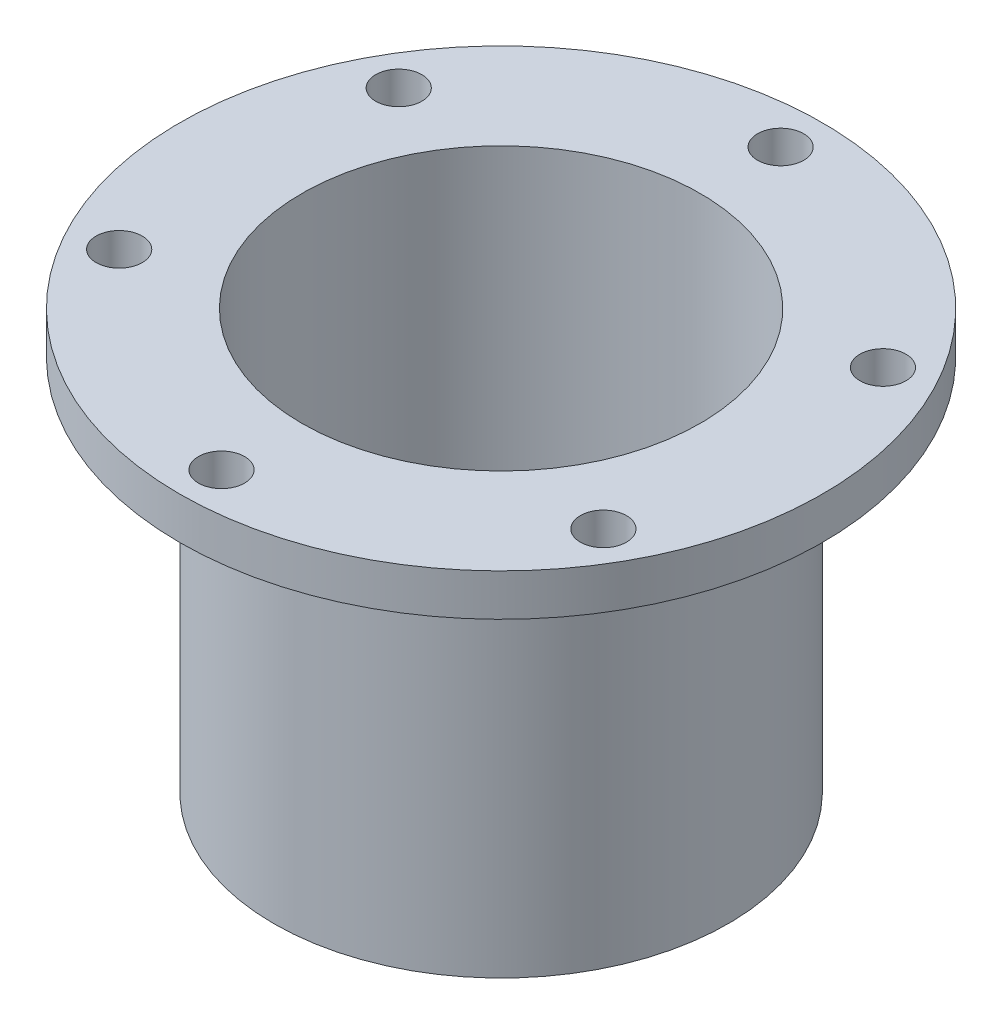
ISO-10303-21;
HEADER;
FILE_DESCRIPTION(('STEP AP214'),'2;1');
FILE_NAME('part.step','',(''),(''),'','','');
FILE_SCHEMA(('AUTOMOTIVE_DESIGN { 1 0 10303 214 1 1 1 1 }'));
ENDSEC;
DATA;
#1=APPLICATION_CONTEXT('core data for automotive mechanical design processes');
#2=APPLICATION_PROTOCOL_DEFINITION('international standard','automotive_design',2000,#1);
#3=PRODUCT_CONTEXT('',#1,'mechanical');
#4=PRODUCT('Part','Part','',(#3));
#5=PRODUCT_RELATED_PRODUCT_CATEGORY('part','',(#4));
#6=PRODUCT_DEFINITION_FORMATION('','',#4);
#7=PRODUCT_DEFINITION_CONTEXT('part definition',#1,'design');
#8=PRODUCT_DEFINITION('design','',#6,#7);
#9=PRODUCT_DEFINITION_SHAPE('','',#8);
#10=(LENGTH_UNIT() NAMED_UNIT(*) SI_UNIT(.MILLI.,.METRE.));
#11=(NAMED_UNIT(*) PLANE_ANGLE_UNIT() SI_UNIT($,.RADIAN.));
#12=(NAMED_UNIT(*) SI_UNIT($,.STERADIAN.) SOLID_ANGLE_UNIT());
#13=UNCERTAINTY_MEASURE_WITH_UNIT(LENGTH_MEASURE(1.E-05),#10,'distance_accuracy_value','');
#14=(GEOMETRIC_REPRESENTATION_CONTEXT(3) GLOBAL_UNCERTAINTY_ASSIGNED_CONTEXT((#13)) GLOBAL_UNIT_ASSIGNED_CONTEXT((#10,
#11,#12)) REPRESENTATION_CONTEXT('',''));
#15=CARTESIAN_POINT('',(0.,0.,0.));
#16=DIRECTION('',(0.,0.,1.));
#17=DIRECTION('',(1.,0.,0.));
#18=AXIS2_PLACEMENT_3D('',#15,#16,#17);
#19=CARTESIAN_POINT('',(0.,27.,0.));
#20=DIRECTION('',(0.,-1.,0.));
#21=DIRECTION('',(0.,0.,-1.));
#22=AXIS2_PLACEMENT_3D('',#19,#20,#21);
#23=CYLINDRICAL_SURFACE('',#22,16.25);
#24=CARTESIAN_POINT('',(0.,27.,0.));
#25=DIRECTION('',(0.,1.,0.));
#26=DIRECTION('',(0.,0.,1.));
#27=AXIS2_PLACEMENT_3D('',#24,#25,#26);
#28=CIRCLE('',#27,16.25);
#29=CARTESIAN_POINT('',(0.,27.,16.25));
#30=VERTEX_POINT('',#29);
#31=EDGE_CURVE('E10',#30,#30,#28,.T.);
#32=ORIENTED_EDGE('',*,*,#31,.F.);
#33=EDGE_LOOP('',(#32));
#34=FACE_BOUND('',#33,.T.);
#35=CARTESIAN_POINT('',(0.,0.,0.));
#36=DIRECTION('',(0.,1.,0.));
#37=DIRECTION('',(0.,0.,1.));
#38=AXIS2_PLACEMENT_3D('',#35,#36,#37);
#39=CIRCLE('',#38,16.25);
#40=CARTESIAN_POINT('',(0.,0.,16.25));
#41=VERTEX_POINT('',#40);
#42=EDGE_CURVE('E39',#41,#41,#39,.T.);
#43=ORIENTED_EDGE('',*,*,#42,.T.);
#44=EDGE_LOOP('',(#43));
#45=FACE_BOUND('',#44,.T.);
#46=ADVANCED_FACE('F32',(#34,#45),#23,.T.);
#47=CARTESIAN_POINT('',(0.,0.,0.));
#48=DIRECTION('',(0.,1.,0.));
#49=DIRECTION('',(0.,0.,1.));
#50=AXIS2_PLACEMENT_3D('',#47,#48,#49);
#51=PLANE('',#50);
#52=CARTESIAN_POINT('',(4.74999999999995,0.,8.2272413359522));
#53=DIRECTION('',(0.,-1.,0.));
#54=DIRECTION('',(0.,0.,-1.));
#55=AXIS2_PLACEMENT_3D('',#52,#53,#54);
#56=CIRCLE('',#55,1.65);
#57=CARTESIAN_POINT('',(4.74999999999995,0.,6.57724133595219));
#58=VERTEX_POINT('',#57);
#59=EDGE_CURVE('E105',#58,#58,#56,.T.);
#60=ORIENTED_EDGE('',*,*,#59,.F.);
#61=EDGE_LOOP('',(#60));
#62=FACE_BOUND('',#61,.T.);
#63=CARTESIAN_POINT('',(9.5,0.,0.));
#64=DIRECTION('',(0.,-1.,0.));
#65=DIRECTION('',(0.,0.,-1.));
#66=AXIS2_PLACEMENT_3D('',#63,#64,#65);
#67=CIRCLE('',#66,1.65000000000002);
#68=CARTESIAN_POINT('',(9.5,0.,-1.64999999999996));
#69=VERTEX_POINT('',#68);
#70=EDGE_CURVE('E108',#69,#69,#67,.T.);
#71=ORIENTED_EDGE('',*,*,#70,.F.);
#72=EDGE_LOOP('',(#71));
#73=FACE_BOUND('',#72,.T.);
#74=CARTESIAN_POINT('',(4.75000000000005,0.,-8.22724133595214));
#75=DIRECTION('',(0.,-1.,0.));
#76=DIRECTION('',(0.,0.,-1.));
#77=AXIS2_PLACEMENT_3D('',#74,#75,#76);
#78=CIRCLE('',#77,1.65000000000004);
#79=CARTESIAN_POINT('',(4.75000000000005,0.,-9.87724133595217));
#80=VERTEX_POINT('',#79);
#81=EDGE_CURVE('E111',#80,#80,#78,.T.);
#82=ORIENTED_EDGE('',*,*,#81,.F.);
#83=EDGE_LOOP('',(#82));
#84=FACE_BOUND('',#83,.T.);
#85=CARTESIAN_POINT('',(-4.74999999999995,0.,-8.2272413359522));
#86=DIRECTION('',(0.,-1.,0.));
#87=DIRECTION('',(0.,0.,-1.));
#88=AXIS2_PLACEMENT_3D('',#85,#86,#87);
#89=CIRCLE('',#88,1.65000000000005);
#90=CARTESIAN_POINT('',(-4.74999999999995,0.,-9.87724133595224));
#91=VERTEX_POINT('',#90);
#92=EDGE_CURVE('E102',#91,#91,#89,.T.);
#93=ORIENTED_EDGE('',*,*,#92,.F.);
#94=EDGE_LOOP('',(#93));
#95=FACE_BOUND('',#94,.T.);
#96=CARTESIAN_POINT('',(-9.5,0.,0.));
#97=DIRECTION('',(0.,-1.,0.));
#98=DIRECTION('',(0.,0.,-1.));
#99=AXIS2_PLACEMENT_3D('',#96,#97,#98);
#100=CIRCLE('',#99,1.65000000000006);
#101=CARTESIAN_POINT('',(-9.5,0.,-1.65000000000012));
#102=VERTEX_POINT('',#101);
#103=EDGE_CURVE('E99',#102,#102,#100,.T.);
#104=ORIENTED_EDGE('',*,*,#103,.F.);
#105=EDGE_LOOP('',(#104));
#106=FACE_BOUND('',#105,.T.);
#107=CARTESIAN_POINT('',(-4.75000000000006,0.,8.22724133595213));
#108=DIRECTION('',(0.,-1.,0.));
#109=DIRECTION('',(0.,0.,-1.));
#110=AXIS2_PLACEMENT_3D('',#107,#108,#109);
#111=CIRCLE('',#110,1.65000000000008);
#112=CARTESIAN_POINT('',(-4.75000000000006,0.,6.57724133595205));
#113=VERTEX_POINT('',#112);
#114=EDGE_CURVE('E97',#113,#113,#111,.T.);
#115=ORIENTED_EDGE('',*,*,#114,.F.);
#116=EDGE_LOOP('',(#115));
#117=FACE_BOUND('',#116,.T.);
#118=CARTESIAN_POINT('',(0.,0.,0.));
#119=DIRECTION('',(0.,-1.,0.));
#120=DIRECTION('',(0.,0.,-1.));
#121=AXIS2_PLACEMENT_3D('',#118,#119,#120);
#122=CIRCLE('',#121,6.75);
#123=CARTESIAN_POINT('',(0.,0.,-6.75));
#124=VERTEX_POINT('',#123);
#125=EDGE_CURVE('E53',#124,#124,#122,.T.);
#126=ORIENTED_EDGE('',*,*,#125,.F.);
#127=EDGE_LOOP('',(#126));
#128=FACE_BOUND('',#127,.T.);
#129=ORIENTED_EDGE('',*,*,#42,.F.);
#130=EDGE_LOOP('',(#129));
#131=FACE_BOUND('',#130,.T.);
#132=ADVANCED_FACE('F79',(#62,#73,#84,#95,#106,#117,#128,#131),#51,.F.);
#133=CARTESIAN_POINT('',(0.,27.,0.));
#134=DIRECTION('',(0.,-1.,0.));
#135=DIRECTION('',(0.,0.,-1.));
#136=AXIS2_PLACEMENT_3D('',#133,#134,#135);
#137=CYLINDRICAL_SURFACE('',#136,14.25);
#138=CARTESIAN_POINT('',(0.,2.,0.));
#139=DIRECTION('',(0.,1.,0.));
#140=DIRECTION('',(0.,0.,1.));
#141=AXIS2_PLACEMENT_3D('',#138,#139,#140);
#142=CIRCLE('',#141,14.25);
#143=CARTESIAN_POINT('',(0.,2.,14.25));
#144=VERTEX_POINT('',#143);
#145=EDGE_CURVE('E44',#144,#144,#142,.T.);
#146=ORIENTED_EDGE('',*,*,#145,.F.);
#147=EDGE_LOOP('',(#146));
#148=FACE_BOUND('',#147,.T.);
#149=CARTESIAN_POINT('',(0.,30.,0.));
#150=DIRECTION('',(0.,1.,0.));
#151=DIRECTION('',(0.,0.,1.));
#152=AXIS2_PLACEMENT_3D('',#149,#150,#151);
#153=CIRCLE('',#152,14.25);
#154=CARTESIAN_POINT('',(0.,30.,14.25));
#155=VERTEX_POINT('',#154);
#156=EDGE_CURVE('E83',#155,#155,#153,.T.);
#157=ORIENTED_EDGE('',*,*,#156,.T.);
#158=EDGE_LOOP('',(#157));
#159=FACE_BOUND('',#158,.T.);
#160=ADVANCED_FACE('F76',(#148,#159),#137,.F.);
#161=CARTESIAN_POINT('',(0.,2.,0.));
#162=DIRECTION('',(0.,1.,0.));
#163=DIRECTION('',(0.,0.,1.));
#164=AXIS2_PLACEMENT_3D('',#161,#162,#163);
#165=PLANE('',#164);
#166=CARTESIAN_POINT('',(4.74999999999995,2.,8.2272413359522));
#167=DIRECTION('',(0.,1.,0.));
#168=DIRECTION('',(0.,0.,1.));
#169=AXIS2_PLACEMENT_3D('',#166,#167,#168);
#170=CIRCLE('',#169,1.65);
#171=CARTESIAN_POINT('',(4.74999999999995,2.,9.8772413359522));
#172=VERTEX_POINT('',#171);
#173=EDGE_CURVE('E35',#172,#172,#170,.T.);
#174=ORIENTED_EDGE('',*,*,#173,.F.);
#175=EDGE_LOOP('',(#174));
#176=FACE_BOUND('',#175,.T.);
#177=CARTESIAN_POINT('',(9.5,2.,0.));
#178=DIRECTION('',(0.,1.,0.));
#179=DIRECTION('',(0.,0.,1.));
#180=AXIS2_PLACEMENT_3D('',#177,#178,#179);
#181=CIRCLE('',#180,1.65000000000002);
#182=CARTESIAN_POINT('',(9.5,2.,1.65000000000008));
#183=VERTEX_POINT('',#182);
#184=EDGE_CURVE('E64',#183,#183,#181,.T.);
#185=ORIENTED_EDGE('',*,*,#184,.F.);
#186=EDGE_LOOP('',(#185));
#187=FACE_BOUND('',#186,.T.);
#188=CARTESIAN_POINT('',(4.75000000000005,2.,-8.22724133595214));
#189=DIRECTION('',(0.,1.,0.));
#190=DIRECTION('',(0.,0.,1.));
#191=AXIS2_PLACEMENT_3D('',#188,#189,#190);
#192=CIRCLE('',#191,1.65000000000004);
#193=CARTESIAN_POINT('',(4.75000000000005,2.,-6.5772413359521));
#194=VERTEX_POINT('',#193);
#195=EDGE_CURVE('E62',#194,#194,#192,.T.);
#196=ORIENTED_EDGE('',*,*,#195,.F.);
#197=EDGE_LOOP('',(#196));
#198=FACE_BOUND('',#197,.T.);
#199=CARTESIAN_POINT('',(-4.74999999999995,2.,-8.2272413359522));
#200=DIRECTION('',(0.,1.,0.));
#201=DIRECTION('',(0.,0.,1.));
#202=AXIS2_PLACEMENT_3D('',#199,#200,#201);
#203=CIRCLE('',#202,1.65000000000005);
#204=CARTESIAN_POINT('',(-4.74999999999995,2.,-6.57724133595215));
#205=VERTEX_POINT('',#204);
#206=EDGE_CURVE('E59',#205,#205,#203,.T.);
#207=ORIENTED_EDGE('',*,*,#206,.F.);
#208=EDGE_LOOP('',(#207));
#209=FACE_BOUND('',#208,.T.);
#210=CARTESIAN_POINT('',(-9.5,2.,0.));
#211=DIRECTION('',(0.,1.,0.));
#212=DIRECTION('',(0.,0.,1.));
#213=AXIS2_PLACEMENT_3D('',#210,#211,#212);
#214=CIRCLE('',#213,1.65000000000006);
#215=CARTESIAN_POINT('',(-9.5,2.,1.65));
#216=VERTEX_POINT('',#215);
#217=EDGE_CURVE('E56',#216,#216,#214,.T.);
#218=ORIENTED_EDGE('',*,*,#217,.F.);
#219=EDGE_LOOP('',(#218));
#220=FACE_BOUND('',#219,.T.);
#221=CARTESIAN_POINT('',(-4.75000000000006,2.,8.22724133595213));
#222=DIRECTION('',(0.,1.,0.));
#223=DIRECTION('',(0.,0.,1.));
#224=AXIS2_PLACEMENT_3D('',#221,#222,#223);
#225=CIRCLE('',#224,1.65000000000008);
#226=CARTESIAN_POINT('',(-4.75000000000006,2.,9.87724133595221));
#227=VERTEX_POINT('',#226);
#228=EDGE_CURVE('E52',#227,#227,#225,.T.);
#229=ORIENTED_EDGE('',*,*,#228,.F.);
#230=EDGE_LOOP('',(#229));
#231=FACE_BOUND('',#230,.T.);
#232=CARTESIAN_POINT('',(0.,2.,0.));
#233=DIRECTION('',(0.,1.,0.));
#234=DIRECTION('',(0.,0.,1.));
#235=AXIS2_PLACEMENT_3D('',#232,#233,#234);
#236=CIRCLE('',#235,6.75);
#237=CARTESIAN_POINT('',(0.,2.,6.75));
#238=VERTEX_POINT('',#237);
#239=EDGE_CURVE('E49',#238,#238,#236,.T.);
#240=ORIENTED_EDGE('',*,*,#239,.F.);
#241=EDGE_LOOP('',(#240));
#242=FACE_BOUND('',#241,.T.);
#243=ORIENTED_EDGE('',*,*,#145,.T.);
#244=EDGE_LOOP('',(#243));
#245=FACE_BOUND('',#244,.T.);
#246=ADVANCED_FACE('F74',(#176,#187,#198,#209,#220,#231,#242,#245),#165,.T.);
#247=CARTESIAN_POINT('',(0.,27.,0.));
#248=DIRECTION('',(0.,-1.,0.));
#249=DIRECTION('',(0.,0.,-1.));
#250=AXIS2_PLACEMENT_3D('',#247,#248,#249);
#251=CYLINDRICAL_SURFACE('',#250,6.75);
#252=ORIENTED_EDGE('',*,*,#239,.T.);
#253=EDGE_LOOP('',(#252));
#254=FACE_BOUND('',#253,.T.);
#255=ORIENTED_EDGE('',*,*,#125,.T.);
#256=EDGE_LOOP('',(#255));
#257=FACE_BOUND('',#256,.T.);
#258=ADVANCED_FACE('F118',(#254,#257),#251,.F.);
#259=CARTESIAN_POINT('',(-4.75000000000006,27.,8.22724133595213));
#260=DIRECTION('',(0.,-1.,0.));
#261=DIRECTION('',(0.,0.,-1.));
#262=AXIS2_PLACEMENT_3D('',#259,#260,#261);
#263=CYLINDRICAL_SURFACE('',#262,1.65000000000008);
#264=ORIENTED_EDGE('',*,*,#228,.T.);
#265=EDGE_LOOP('',(#264));
#266=FACE_BOUND('',#265,.T.);
#267=ORIENTED_EDGE('',*,*,#114,.T.);
#268=EDGE_LOOP('',(#267));
#269=FACE_BOUND('',#268,.T.);
#270=ADVANCED_FACE('F152',(#266,#269),#263,.F.);
#271=CARTESIAN_POINT('',(-9.5,27.,0.));
#272=DIRECTION('',(0.,-1.,0.));
#273=DIRECTION('',(0.,0.,-1.));
#274=AXIS2_PLACEMENT_3D('',#271,#272,#273);
#275=CYLINDRICAL_SURFACE('',#274,1.65000000000006);
#276=ORIENTED_EDGE('',*,*,#217,.T.);
#277=EDGE_LOOP('',(#276));
#278=FACE_BOUND('',#277,.T.);
#279=ORIENTED_EDGE('',*,*,#103,.T.);
#280=EDGE_LOOP('',(#279));
#281=FACE_BOUND('',#280,.T.);
#282=ADVANCED_FACE('F160',(#278,#281),#275,.F.);
#283=CARTESIAN_POINT('',(-4.74999999999995,27.,-8.2272413359522));
#284=DIRECTION('',(0.,-1.,0.));
#285=DIRECTION('',(0.,0.,-1.));
#286=AXIS2_PLACEMENT_3D('',#283,#284,#285);
#287=CYLINDRICAL_SURFACE('',#286,1.65000000000005);
#288=ORIENTED_EDGE('',*,*,#206,.T.);
#289=EDGE_LOOP('',(#288));
#290=FACE_BOUND('',#289,.T.);
#291=ORIENTED_EDGE('',*,*,#92,.T.);
#292=EDGE_LOOP('',(#291));
#293=FACE_BOUND('',#292,.T.);
#294=ADVANCED_FACE('F168',(#290,#293),#287,.F.);
#295=CARTESIAN_POINT('',(4.75000000000005,27.,-8.22724133595214));
#296=DIRECTION('',(0.,-1.,0.));
#297=DIRECTION('',(0.,0.,-1.));
#298=AXIS2_PLACEMENT_3D('',#295,#296,#297);
#299=CYLINDRICAL_SURFACE('',#298,1.65000000000004);
#300=ORIENTED_EDGE('',*,*,#195,.T.);
#301=EDGE_LOOP('',(#300));
#302=FACE_BOUND('',#301,.T.);
#303=ORIENTED_EDGE('',*,*,#81,.T.);
#304=EDGE_LOOP('',(#303));
#305=FACE_BOUND('',#304,.T.);
#306=ADVANCED_FACE('F176',(#302,#305),#299,.F.);
#307=CARTESIAN_POINT('',(9.5,27.,0.));
#308=DIRECTION('',(0.,-1.,0.));
#309=DIRECTION('',(0.,0.,-1.));
#310=AXIS2_PLACEMENT_3D('',#307,#308,#309);
#311=CYLINDRICAL_SURFACE('',#310,1.65000000000002);
#312=ORIENTED_EDGE('',*,*,#184,.T.);
#313=EDGE_LOOP('',(#312));
#314=FACE_BOUND('',#313,.T.);
#315=ORIENTED_EDGE('',*,*,#70,.T.);
#316=EDGE_LOOP('',(#315));
#317=FACE_BOUND('',#316,.T.);
#318=ADVANCED_FACE('F184',(#314,#317),#311,.F.);
#319=CARTESIAN_POINT('',(4.74999999999995,27.,8.2272413359522));
#320=DIRECTION('',(0.,-1.,0.));
#321=DIRECTION('',(0.,0.,-1.));
#322=AXIS2_PLACEMENT_3D('',#319,#320,#321);
#323=CYLINDRICAL_SURFACE('',#322,1.65);
#324=ORIENTED_EDGE('',*,*,#173,.T.);
#325=EDGE_LOOP('',(#324));
#326=FACE_BOUND('',#325,.T.);
#327=ORIENTED_EDGE('',*,*,#59,.T.);
#328=EDGE_LOOP('',(#327));
#329=FACE_BOUND('',#328,.T.);
#330=ADVANCED_FACE('F192',(#326,#329),#323,.F.);
#331=CARTESIAN_POINT('',(0.,30.,0.));
#332=DIRECTION('',(0.,1.,0.));
#333=DIRECTION('',(0.,0.,1.));
#334=AXIS2_PLACEMENT_3D('',#331,#332,#333);
#335=PLANE('',#334);
#336=CARTESIAN_POINT('',(-17.3205080756888,30.,10.));
#337=DIRECTION('',(0.,1.,0.));
#338=DIRECTION('',(0.,0.,1.));
#339=AXIS2_PLACEMENT_3D('',#336,#337,#338);
#340=CIRCLE('',#339,1.65);
#341=CARTESIAN_POINT('',(-17.3205080756888,30.,11.65));
#342=VERTEX_POINT('',#341);
#343=EDGE_CURVE('E325',#342,#342,#340,.T.);
#344=ORIENTED_EDGE('',*,*,#343,.F.);
#345=EDGE_LOOP('',(#344));
#346=FACE_BOUND('',#345,.T.);
#347=CARTESIAN_POINT('',(17.3205080756888,30.,10.));
#348=DIRECTION('',(0.,1.,0.));
#349=DIRECTION('',(0.,0.,1.));
#350=AXIS2_PLACEMENT_3D('',#347,#348,#349);
#351=CIRCLE('',#350,1.65);
#352=CARTESIAN_POINT('',(17.3205080756888,30.,11.65));
#353=VERTEX_POINT('',#352);
#354=EDGE_CURVE('E337',#353,#353,#351,.T.);
#355=ORIENTED_EDGE('',*,*,#354,.F.);
#356=EDGE_LOOP('',(#355));
#357=FACE_BOUND('',#356,.T.);
#358=CARTESIAN_POINT('',(0.,30.,-20.));
#359=DIRECTION('',(0.,1.,0.));
#360=DIRECTION('',(0.,0.,1.));
#361=AXIS2_PLACEMENT_3D('',#358,#359,#360);
#362=CIRCLE('',#361,1.65);
#363=CARTESIAN_POINT('',(0.,30.,-18.35));
#364=VERTEX_POINT('',#363);
#365=EDGE_CURVE('E86',#364,#364,#362,.T.);
#366=ORIENTED_EDGE('',*,*,#365,.F.);
#367=EDGE_LOOP('',(#366));
#368=FACE_BOUND('',#367,.T.);
#369=CARTESIAN_POINT('',(0.,30.,0.));
#370=DIRECTION('',(0.,1.,0.));
#371=DIRECTION('',(0.,0.,1.));
#372=AXIS2_PLACEMENT_3D('',#369,#370,#371);
#373=CIRCLE('',#372,23.);
#374=CARTESIAN_POINT('',(0.,30.,23.));
#375=VERTEX_POINT('',#374);
#376=EDGE_CURVE('E89',#375,#375,#373,.T.);
#377=ORIENTED_EDGE('',*,*,#376,.T.);
#378=EDGE_LOOP('',(#377));
#379=FACE_BOUND('',#378,.T.);
#380=ORIENTED_EDGE('',*,*,#156,.F.);
#381=EDGE_LOOP('',(#380));
#382=FACE_BOUND('',#381,.T.);
#383=CARTESIAN_POINT('',(17.3205080756888,30.,-10.));
#384=DIRECTION('',(0.,1.,0.));
#385=DIRECTION('',(0.,0.,1.));
#386=AXIS2_PLACEMENT_3D('',#383,#384,#385);
#387=CIRCLE('',#386,1.65);
#388=CARTESIAN_POINT('',(17.3205080756888,30.,-8.35));
#389=VERTEX_POINT('',#388);
#390=EDGE_CURVE('E343',#389,#389,#387,.T.);
#391=ORIENTED_EDGE('',*,*,#390,.F.);
#392=EDGE_LOOP('',(#391));
#393=FACE_BOUND('',#392,.T.);
#394=CARTESIAN_POINT('',(0.,30.,20.));
#395=DIRECTION('',(0.,1.,0.));
#396=DIRECTION('',(0.,0.,1.));
#397=AXIS2_PLACEMENT_3D('',#394,#395,#396);
#398=CIRCLE('',#397,1.65);
#399=CARTESIAN_POINT('',(0.,30.,21.65));
#400=VERTEX_POINT('',#399);
#401=EDGE_CURVE('E331',#400,#400,#398,.T.);
#402=ORIENTED_EDGE('',*,*,#401,.F.);
#403=EDGE_LOOP('',(#402));
#404=FACE_BOUND('',#403,.T.);
#405=CARTESIAN_POINT('',(-17.3205080756888,30.,-9.99999999999999));
#406=DIRECTION('',(0.,1.,0.));
#407=DIRECTION('',(0.,0.,1.));
#408=AXIS2_PLACEMENT_3D('',#405,#406,#407);
#409=CIRCLE('',#408,1.65);
#410=CARTESIAN_POINT('',(-17.3205080756888,30.,-8.34999999999999));
#411=VERTEX_POINT('',#410);
#412=EDGE_CURVE('E316',#411,#411,#409,.T.);
#413=ORIENTED_EDGE('',*,*,#412,.F.);
#414=EDGE_LOOP('',(#413));
#415=FACE_BOUND('',#414,.T.);
#416=ADVANCED_FACE('F198',(#346,#357,#368,#379,#382,#393,#404,#415),#335,.T.);
#417=CARTESIAN_POINT('',(0.,27.,0.));
#418=DIRECTION('',(0.,1.,0.));
#419=DIRECTION('',(0.,0.,1.));
#420=AXIS2_PLACEMENT_3D('',#417,#418,#419);
#421=PLANE('',#420);
#422=ORIENTED_EDGE('',*,*,#31,.T.);
#423=EDGE_LOOP('',(#422));
#424=FACE_BOUND('',#423,.T.);
#425=CARTESIAN_POINT('',(0.,27.,0.));
#426=DIRECTION('',(0.,1.,0.));
#427=DIRECTION('',(0.,0.,1.));
#428=AXIS2_PLACEMENT_3D('',#425,#426,#427);
#429=CIRCLE('',#428,23.);
#430=CARTESIAN_POINT('',(0.,27.,23.));
#431=VERTEX_POINT('',#430);
#432=EDGE_CURVE('E85',#431,#431,#429,.T.);
#433=ORIENTED_EDGE('',*,*,#432,.F.);
#434=EDGE_LOOP('',(#433));
#435=FACE_BOUND('',#434,.T.);
#436=CARTESIAN_POINT('',(0.,27.,-20.));
#437=DIRECTION('',(0.,1.,0.));
#438=DIRECTION('',(0.,0.,1.));
#439=AXIS2_PLACEMENT_3D('',#436,#437,#438);
#440=CIRCLE('',#439,1.65);
#441=CARTESIAN_POINT('',(0.,27.,-18.35));
#442=VERTEX_POINT('',#441);
#443=EDGE_CURVE('E92',#442,#442,#440,.T.);
#444=ORIENTED_EDGE('',*,*,#443,.T.);
#445=EDGE_LOOP('',(#444));
#446=FACE_BOUND('',#445,.T.);
#447=CARTESIAN_POINT('',(17.3205080756888,27.,-10.));
#448=DIRECTION('',(0.,1.,0.));
#449=DIRECTION('',(0.,0.,1.));
#450=AXIS2_PLACEMENT_3D('',#447,#448,#449);
#451=CIRCLE('',#450,1.65);
#452=CARTESIAN_POINT('',(17.3205080756888,27.,-8.35));
#453=VERTEX_POINT('',#452);
#454=EDGE_CURVE('E340',#453,#453,#451,.T.);
#455=ORIENTED_EDGE('',*,*,#454,.T.);
#456=EDGE_LOOP('',(#455));
#457=FACE_BOUND('',#456,.T.);
#458=CARTESIAN_POINT('',(17.3205080756888,27.,10.));
#459=DIRECTION('',(0.,1.,0.));
#460=DIRECTION('',(0.,0.,1.));
#461=AXIS2_PLACEMENT_3D('',#458,#459,#460);
#462=CIRCLE('',#461,1.65);
#463=CARTESIAN_POINT('',(17.3205080756888,27.,11.65));
#464=VERTEX_POINT('',#463);
#465=EDGE_CURVE('E334',#464,#464,#462,.T.);
#466=ORIENTED_EDGE('',*,*,#465,.T.);
#467=EDGE_LOOP('',(#466));
#468=FACE_BOUND('',#467,.T.);
#469=CARTESIAN_POINT('',(0.,27.,20.));
#470=DIRECTION('',(0.,1.,0.));
#471=DIRECTION('',(0.,0.,1.));
#472=AXIS2_PLACEMENT_3D('',#469,#470,#471);
#473=CIRCLE('',#472,1.65);
#474=CARTESIAN_POINT('',(0.,27.,21.65));
#475=VERTEX_POINT('',#474);
#476=EDGE_CURVE('E328',#475,#475,#473,.T.);
#477=ORIENTED_EDGE('',*,*,#476,.T.);
#478=EDGE_LOOP('',(#477));
#479=FACE_BOUND('',#478,.T.);
#480=CARTESIAN_POINT('',(-17.3205080756888,27.,10.));
#481=DIRECTION('',(0.,1.,0.));
#482=DIRECTION('',(0.,0.,1.));
#483=AXIS2_PLACEMENT_3D('',#480,#481,#482);
#484=CIRCLE('',#483,1.65);
#485=CARTESIAN_POINT('',(-17.3205080756888,27.,11.65));
#486=VERTEX_POINT('',#485);
#487=EDGE_CURVE('E322',#486,#486,#484,.T.);
#488=ORIENTED_EDGE('',*,*,#487,.T.);
#489=EDGE_LOOP('',(#488));
#490=FACE_BOUND('',#489,.T.);
#491=CARTESIAN_POINT('',(-17.3205080756888,27.,-9.99999999999999));
#492=DIRECTION('',(0.,1.,0.));
#493=DIRECTION('',(0.,0.,1.));
#494=AXIS2_PLACEMENT_3D('',#491,#492,#493);
#495=CIRCLE('',#494,1.65);
#496=CARTESIAN_POINT('',(-17.3205080756888,27.,-8.34999999999999));
#497=VERTEX_POINT('',#496);
#498=EDGE_CURVE('E319',#497,#497,#495,.T.);
#499=ORIENTED_EDGE('',*,*,#498,.T.);
#500=EDGE_LOOP('',(#499));
#501=FACE_BOUND('',#500,.T.);
#502=ADVANCED_FACE('F204',(#424,#435,#446,#457,#468,#479,#490,#501),#421,.F.);
#503=CARTESIAN_POINT('',(0.,30.,0.));
#504=DIRECTION('',(0.,-1.,0.));
#505=DIRECTION('',(0.,0.,-1.));
#506=AXIS2_PLACEMENT_3D('',#503,#504,#505);
#507=CYLINDRICAL_SURFACE('',#506,23.);
#508=ORIENTED_EDGE('',*,*,#376,.F.);
#509=EDGE_LOOP('',(#508));
#510=FACE_BOUND('',#509,.T.);
#511=ORIENTED_EDGE('',*,*,#432,.T.);
#512=EDGE_LOOP('',(#511));
#513=FACE_BOUND('',#512,.T.);
#514=ADVANCED_FACE('F212',(#510,#513),#507,.T.);
#515=CARTESIAN_POINT('',(0.,30.,-20.));
#516=DIRECTION('',(0.,-1.,0.));
#517=DIRECTION('',(0.,0.,-1.));
#518=AXIS2_PLACEMENT_3D('',#515,#516,#517);
#519=CYLINDRICAL_SURFACE('',#518,1.65);
#520=ORIENTED_EDGE('',*,*,#365,.T.);
#521=EDGE_LOOP('',(#520));
#522=FACE_BOUND('',#521,.T.);
#523=ORIENTED_EDGE('',*,*,#443,.F.);
#524=EDGE_LOOP('',(#523));
#525=FACE_BOUND('',#524,.T.);
#526=ADVANCED_FACE('F219',(#522,#525),#519,.F.);
#527=CARTESIAN_POINT('',(17.3205080756888,30.,-10.));
#528=DIRECTION('',(0.,-1.,0.));
#529=DIRECTION('',(0.,0.,-1.));
#530=AXIS2_PLACEMENT_3D('',#527,#528,#529);
#531=CYLINDRICAL_SURFACE('',#530,1.65);
#532=ORIENTED_EDGE('',*,*,#390,.T.);
#533=EDGE_LOOP('',(#532));
#534=FACE_BOUND('',#533,.T.);
#535=ORIENTED_EDGE('',*,*,#454,.F.);
#536=EDGE_LOOP('',(#535));
#537=FACE_BOUND('',#536,.T.);
#538=ADVANCED_FACE('F227',(#534,#537),#531,.F.);
#539=CARTESIAN_POINT('',(17.3205080756888,30.,10.));
#540=DIRECTION('',(0.,-1.,0.));
#541=DIRECTION('',(0.,0.,-1.));
#542=AXIS2_PLACEMENT_3D('',#539,#540,#541);
#543=CYLINDRICAL_SURFACE('',#542,1.65);
#544=ORIENTED_EDGE('',*,*,#354,.T.);
#545=EDGE_LOOP('',(#544));
#546=FACE_BOUND('',#545,.T.);
#547=ORIENTED_EDGE('',*,*,#465,.F.);
#548=EDGE_LOOP('',(#547));
#549=FACE_BOUND('',#548,.T.);
#550=ADVANCED_FACE('F235',(#546,#549),#543,.F.);
#551=CARTESIAN_POINT('',(0.,30.,20.));
#552=DIRECTION('',(0.,-1.,0.));
#553=DIRECTION('',(0.,0.,-1.));
#554=AXIS2_PLACEMENT_3D('',#551,#552,#553);
#555=CYLINDRICAL_SURFACE('',#554,1.65);
#556=ORIENTED_EDGE('',*,*,#401,.T.);
#557=EDGE_LOOP('',(#556));
#558=FACE_BOUND('',#557,.T.);
#559=ORIENTED_EDGE('',*,*,#476,.F.);
#560=EDGE_LOOP('',(#559));
#561=FACE_BOUND('',#560,.T.);
#562=ADVANCED_FACE('F243',(#558,#561),#555,.F.);
#563=CARTESIAN_POINT('',(-17.3205080756888,30.,10.));
#564=DIRECTION('',(0.,-1.,0.));
#565=DIRECTION('',(0.,0.,-1.));
#566=AXIS2_PLACEMENT_3D('',#563,#564,#565);
#567=CYLINDRICAL_SURFACE('',#566,1.65);
#568=ORIENTED_EDGE('',*,*,#343,.T.);
#569=EDGE_LOOP('',(#568));
#570=FACE_BOUND('',#569,.T.);
#571=ORIENTED_EDGE('',*,*,#487,.F.);
#572=EDGE_LOOP('',(#571));
#573=FACE_BOUND('',#572,.T.);
#574=ADVANCED_FACE('F251',(#570,#573),#567,.F.);
#575=CARTESIAN_POINT('',(-17.3205080756888,30.,-9.99999999999999));
#576=DIRECTION('',(0.,-1.,0.));
#577=DIRECTION('',(0.,0.,-1.));
#578=AXIS2_PLACEMENT_3D('',#575,#576,#577);
#579=CYLINDRICAL_SURFACE('',#578,1.65);
#580=ORIENTED_EDGE('',*,*,#412,.T.);
#581=EDGE_LOOP('',(#580));
#582=FACE_BOUND('',#581,.T.);
#583=ORIENTED_EDGE('',*,*,#498,.F.);
#584=EDGE_LOOP('',(#583));
#585=FACE_BOUND('',#584,.T.);
#586=ADVANCED_FACE('F259',(#582,#585),#579,.F.);
#587=CLOSED_SHELL('',(#46,#132,#160,#246,#258,#270,#282,#294,#306,#318,#330,#416,#502,#514,#526,
#538,#550,#562,#574,#586));
#588=MANIFOLD_SOLID_BREP('B2',#587);
#589=ADVANCED_BREP_SHAPE_REPRESENTATION('',(#18,#588),#14);
#590=SHAPE_DEFINITION_REPRESENTATION(#9,#589);
ENDSEC;
END-ISO-10303-21;
